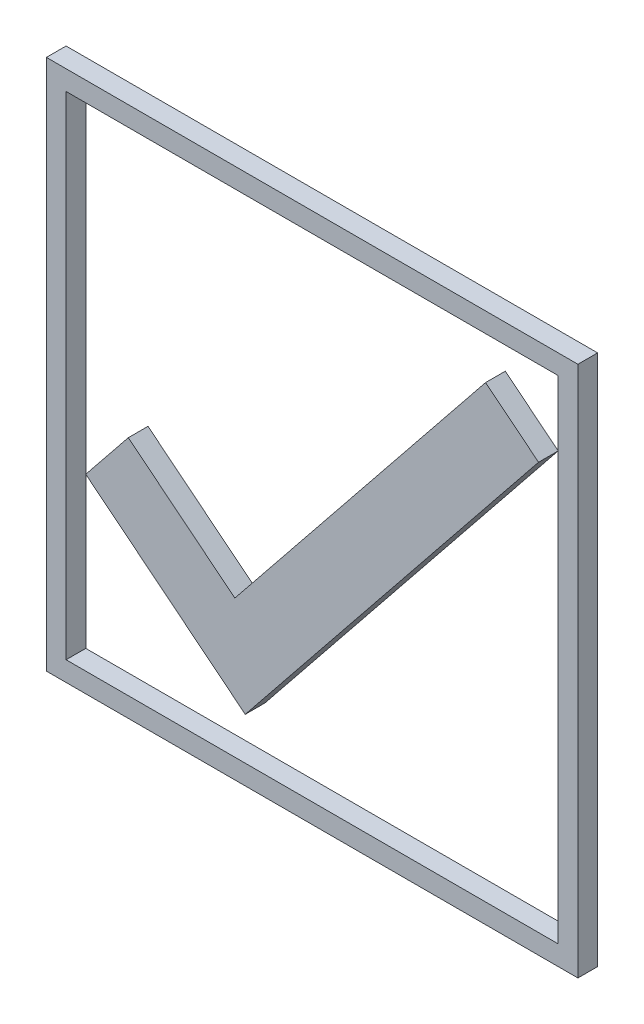
ISO-10303-21;
HEADER;
FILE_DESCRIPTION(('STEP AP214'),'2;1');
FILE_NAME('part.step','',(''),(''),'','','');
FILE_SCHEMA(('AUTOMOTIVE_DESIGN { 1 0 10303 214 1 1 1 1 }'));
ENDSEC;
DATA;
#1=APPLICATION_CONTEXT('core data for automotive mechanical design processes');
#2=APPLICATION_PROTOCOL_DEFINITION('international standard','automotive_design',2000,#1);
#3=PRODUCT_CONTEXT('',#1,'mechanical');
#4=PRODUCT('Part','Part','',(#3));
#5=PRODUCT_RELATED_PRODUCT_CATEGORY('part','',(#4));
#6=PRODUCT_DEFINITION_FORMATION('','',#4);
#7=PRODUCT_DEFINITION_CONTEXT('part definition',#1,'design');
#8=PRODUCT_DEFINITION('design','',#6,#7);
#9=PRODUCT_DEFINITION_SHAPE('','',#8);
#10=(LENGTH_UNIT() NAMED_UNIT(*) SI_UNIT(.MILLI.,.METRE.));
#11=(NAMED_UNIT(*) PLANE_ANGLE_UNIT() SI_UNIT($,.RADIAN.));
#12=(NAMED_UNIT(*) SI_UNIT($,.STERADIAN.) SOLID_ANGLE_UNIT());
#13=UNCERTAINTY_MEASURE_WITH_UNIT(LENGTH_MEASURE(1.E-05),#10,'distance_accuracy_value','');
#14=(GEOMETRIC_REPRESENTATION_CONTEXT(3) GLOBAL_UNCERTAINTY_ASSIGNED_CONTEXT((#13)) GLOBAL_UNIT_ASSIGNED_CONTEXT((#10,
#11,#12)) REPRESENTATION_CONTEXT('',''));
#15=CARTESIAN_POINT('',(0.,0.,0.));
#16=DIRECTION('',(0.,0.,1.));
#17=DIRECTION('',(1.,0.,0.));
#18=AXIS2_PLACEMENT_3D('',#15,#16,#17);
#19=CARTESIAN_POINT('',(0.,-27.,2.));
#20=DIRECTION('',(0.,1.,0.));
#21=DIRECTION('',(0.,0.,1.));
#22=AXIS2_PLACEMENT_3D('',#19,#20,#21);
#23=PLANE('',#22);
#24=DIRECTION('',(1.,0.,0.));
#25=VECTOR('',#24,1.);
#26=CARTESIAN_POINT('',(0.,-27.,0.));
#27=LINE('',#26,#25);
#28=CARTESIAN_POINT('',(-27.,-27.,0.));
#29=VERTEX_POINT('',#28);
#30=CARTESIAN_POINT('',(27.,-27.,0.));
#31=VERTEX_POINT('',#30);
#32=EDGE_CURVE('E186',#29,#31,#27,.T.);
#33=ORIENTED_EDGE('',*,*,#32,.T.);
#34=DIRECTION('',(0.,0.,-1.));
#35=VECTOR('',#34,1.);
#36=CARTESIAN_POINT('',(27.,-27.,2.));
#37=LINE('',#36,#35);
#38=CARTESIAN_POINT('',(27.,-27.,2.));
#39=VERTEX_POINT('',#38);
#40=EDGE_CURVE('E13',#39,#31,#37,.T.);
#41=ORIENTED_EDGE('',*,*,#40,.F.);
#42=DIRECTION('',(1.,0.,0.));
#43=VECTOR('',#42,1.);
#44=CARTESIAN_POINT('',(0.,-27.,2.));
#45=LINE('',#44,#43);
#46=CARTESIAN_POINT('',(-27.,-27.,2.));
#47=VERTEX_POINT('',#46);
#48=EDGE_CURVE('E158',#47,#39,#45,.T.);
#49=ORIENTED_EDGE('',*,*,#48,.F.);
#50=DIRECTION('',(0.,0.,-1.));
#51=VECTOR('',#50,1.);
#52=CARTESIAN_POINT('',(-27.,-27.,2.));
#53=LINE('',#52,#51);
#54=EDGE_CURVE('E98',#47,#29,#53,.T.);
#55=ORIENTED_EDGE('',*,*,#54,.T.);
#56=EDGE_LOOP('',(#33,#41,#49,#55));
#57=FACE_BOUND('',#56,.T.);
#58=ADVANCED_FACE('F79',(#57),#23,.F.);
#59=CARTESIAN_POINT('',(27.,0.,2.));
#60=DIRECTION('',(-1.,0.,0.));
#61=DIRECTION('',(0.,0.,1.));
#62=AXIS2_PLACEMENT_3D('',#59,#60,#61);
#63=PLANE('',#62);
#64=DIRECTION('',(0.,1.,0.));
#65=VECTOR('',#64,1.);
#66=CARTESIAN_POINT('',(27.,0.,0.));
#67=LINE('',#66,#65);
#68=CARTESIAN_POINT('',(27.,27.,0.));
#69=VERTEX_POINT('',#68);
#70=EDGE_CURVE('E164',#31,#69,#67,.T.);
#71=ORIENTED_EDGE('',*,*,#70,.T.);
#72=DIRECTION('',(0.,0.,-1.));
#73=VECTOR('',#72,1.);
#74=CARTESIAN_POINT('',(27.,27.,2.));
#75=LINE('',#74,#73);
#76=CARTESIAN_POINT('',(27.,27.,2.));
#77=VERTEX_POINT('',#76);
#78=EDGE_CURVE('E89',#77,#69,#75,.T.);
#79=ORIENTED_EDGE('',*,*,#78,.F.);
#80=DIRECTION('',(0.,1.,0.));
#81=VECTOR('',#80,1.);
#82=CARTESIAN_POINT('',(27.,0.,2.));
#83=LINE('',#82,#81);
#84=EDGE_CURVE('E152',#39,#77,#83,.T.);
#85=ORIENTED_EDGE('',*,*,#84,.F.);
#86=ORIENTED_EDGE('',*,*,#40,.T.);
#87=EDGE_LOOP('',(#71,#79,#85,#86));
#88=FACE_BOUND('',#87,.T.);
#89=ADVANCED_FACE('F163',(#88),#63,.F.);
#90=CARTESIAN_POINT('',(0.,27.,2.));
#91=DIRECTION('',(0.,1.,0.));
#92=DIRECTION('',(-1.,0.,0.));
#93=AXIS2_PLACEMENT_3D('',#90,#91,#92);
#94=PLANE('',#93);
#95=DIRECTION('',(1.,0.,0.));
#96=VECTOR('',#95,1.);
#97=CARTESIAN_POINT('',(0.,27.,0.));
#98=LINE('',#97,#96);
#99=CARTESIAN_POINT('',(-27.,27.,0.));
#100=VERTEX_POINT('',#99);
#101=EDGE_CURVE('E189',#100,#69,#98,.T.);
#102=ORIENTED_EDGE('',*,*,#101,.F.);
#103=DIRECTION('',(0.,0.,-1.));
#104=VECTOR('',#103,1.);
#105=CARTESIAN_POINT('',(-27.,27.,2.));
#106=LINE('',#105,#104);
#107=CARTESIAN_POINT('',(-27.,27.,2.));
#108=VERTEX_POINT('',#107);
#109=EDGE_CURVE('E124',#108,#100,#106,.T.);
#110=ORIENTED_EDGE('',*,*,#109,.F.);
#111=DIRECTION('',(1.,0.,0.));
#112=VECTOR('',#111,1.);
#113=CARTESIAN_POINT('',(0.,27.,2.));
#114=LINE('',#113,#112);
#115=EDGE_CURVE('E157',#108,#77,#114,.T.);
#116=ORIENTED_EDGE('',*,*,#115,.T.);
#117=ORIENTED_EDGE('',*,*,#78,.T.);
#118=EDGE_LOOP('',(#102,#110,#116,#117));
#119=FACE_BOUND('',#118,.T.);
#120=ADVANCED_FACE('F168',(#119),#94,.T.);
#121=CARTESIAN_POINT('',(25.,0.,2.));
#122=DIRECTION('',(-1.,0.,0.));
#123=DIRECTION('',(0.,0.,1.));
#124=AXIS2_PLACEMENT_3D('',#121,#122,#123);
#125=PLANE('',#124);
#126=DIRECTION('',(0.,1.,0.));
#127=VECTOR('',#126,1.);
#128=CARTESIAN_POINT('',(25.,0.,0.));
#129=LINE('',#128,#127);
#130=CARTESIAN_POINT('',(25.,-25.,0.));
#131=VERTEX_POINT('',#130);
#132=CARTESIAN_POINT('',(25.,25.,0.));
#133=VERTEX_POINT('',#132);
#134=EDGE_CURVE('E175',#131,#133,#129,.T.);
#135=ORIENTED_EDGE('',*,*,#134,.F.);
#136=DIRECTION('',(0.,0.,-1.));
#137=VECTOR('',#136,1.);
#138=CARTESIAN_POINT('',(25.,-25.,2.));
#139=LINE('',#138,#137);
#140=CARTESIAN_POINT('',(25.,-25.,2.));
#141=VERTEX_POINT('',#140);
#142=EDGE_CURVE('E83',#141,#131,#139,.T.);
#143=ORIENTED_EDGE('',*,*,#142,.F.);
#144=DIRECTION('',(0.,1.,0.));
#145=VECTOR('',#144,1.);
#146=CARTESIAN_POINT('',(25.,0.,2.));
#147=LINE('',#146,#145);
#148=CARTESIAN_POINT('',(25.,25.,2.));
#149=VERTEX_POINT('',#148);
#150=EDGE_CURVE('E194',#141,#149,#147,.T.);
#151=ORIENTED_EDGE('',*,*,#150,.T.);
#152=DIRECTION('',(0.,0.,-1.));
#153=VECTOR('',#152,1.);
#154=CARTESIAN_POINT('',(25.,25.,2.));
#155=LINE('',#154,#153);
#156=EDGE_CURVE('E171',#149,#133,#155,.T.);
#157=ORIENTED_EDGE('',*,*,#156,.T.);
#158=EDGE_LOOP('',(#135,#143,#151,#157));
#159=FACE_BOUND('',#158,.T.);
#160=ADVANCED_FACE('F81',(#159),#125,.T.);
#161=CARTESIAN_POINT('',(0.,-25.,2.));
#162=DIRECTION('',(0.,1.,0.));
#163=DIRECTION('',(-1.,0.,0.));
#164=AXIS2_PLACEMENT_3D('',#161,#162,#163);
#165=PLANE('',#164);
#166=DIRECTION('',(1.,0.,0.));
#167=VECTOR('',#166,1.);
#168=CARTESIAN_POINT('',(0.,-25.,0.));
#169=LINE('',#168,#167);
#170=CARTESIAN_POINT('',(-25.,-25.,0.));
#171=VERTEX_POINT('',#170);
#172=EDGE_CURVE('E178',#171,#131,#169,.T.);
#173=ORIENTED_EDGE('',*,*,#172,.F.);
#174=DIRECTION('',(0.,0.,-1.));
#175=VECTOR('',#174,1.);
#176=CARTESIAN_POINT('',(-25.,-25.,2.));
#177=LINE('',#176,#175);
#178=CARTESIAN_POINT('',(-25.,-25.,2.));
#179=VERTEX_POINT('',#178);
#180=EDGE_CURVE('E200',#179,#171,#177,.T.);
#181=ORIENTED_EDGE('',*,*,#180,.F.);
#182=DIRECTION('',(1.,0.,0.));
#183=VECTOR('',#182,1.);
#184=CARTESIAN_POINT('',(0.,-25.,2.));
#185=LINE('',#184,#183);
#186=EDGE_CURVE('E209',#179,#141,#185,.T.);
#187=ORIENTED_EDGE('',*,*,#186,.T.);
#188=ORIENTED_EDGE('',*,*,#142,.T.);
#189=EDGE_LOOP('',(#173,#181,#187,#188));
#190=FACE_BOUND('',#189,.T.);
#191=ADVANCED_FACE('F207',(#190),#165,.T.);
#192=CARTESIAN_POINT('',(-25.,0.,2.));
#193=DIRECTION('',(-1.,0.,0.));
#194=DIRECTION('',(0.,0.,1.));
#195=AXIS2_PLACEMENT_3D('',#192,#193,#194);
#196=PLANE('',#195);
#197=DIRECTION('',(0.,1.,0.));
#198=VECTOR('',#197,1.);
#199=CARTESIAN_POINT('',(-25.,0.,0.));
#200=LINE('',#199,#198);
#201=CARTESIAN_POINT('',(-25.,25.,0.));
#202=VERTEX_POINT('',#201);
#203=EDGE_CURVE('E181',#171,#202,#200,.T.);
#204=ORIENTED_EDGE('',*,*,#203,.T.);
#205=DIRECTION('',(0.,0.,-1.));
#206=VECTOR('',#205,1.);
#207=CARTESIAN_POINT('',(-25.,25.,2.));
#208=LINE('',#207,#206);
#209=CARTESIAN_POINT('',(-25.,25.,2.));
#210=VERTEX_POINT('',#209);
#211=EDGE_CURVE('E198',#210,#202,#208,.T.);
#212=ORIENTED_EDGE('',*,*,#211,.F.);
#213=DIRECTION('',(0.,1.,0.));
#214=VECTOR('',#213,1.);
#215=CARTESIAN_POINT('',(-25.,0.,2.));
#216=LINE('',#215,#214);
#217=EDGE_CURVE('E222',#179,#210,#216,.T.);
#218=ORIENTED_EDGE('',*,*,#217,.F.);
#219=ORIENTED_EDGE('',*,*,#180,.T.);
#220=EDGE_LOOP('',(#204,#212,#218,#219));
#221=FACE_BOUND('',#220,.T.);
#222=ADVANCED_FACE('F216',(#221),#196,.F.);
#223=CARTESIAN_POINT('',(0.,25.,2.));
#224=DIRECTION('',(0.,1.,0.));
#225=DIRECTION('',(-1.,0.,0.));
#226=AXIS2_PLACEMENT_3D('',#223,#224,#225);
#227=PLANE('',#226);
#228=DIRECTION('',(1.,0.,0.));
#229=VECTOR('',#228,1.);
#230=CARTESIAN_POINT('',(0.,25.,0.));
#231=LINE('',#230,#229);
#232=EDGE_CURVE('E183',#202,#133,#231,.T.);
#233=ORIENTED_EDGE('',*,*,#232,.T.);
#234=ORIENTED_EDGE('',*,*,#156,.F.);
#235=DIRECTION('',(1.,0.,0.));
#236=VECTOR('',#235,1.);
#237=CARTESIAN_POINT('',(0.,25.,2.));
#238=LINE('',#237,#236);
#239=EDGE_CURVE('E220',#210,#149,#238,.T.);
#240=ORIENTED_EDGE('',*,*,#239,.F.);
#241=ORIENTED_EDGE('',*,*,#211,.T.);
#242=EDGE_LOOP('',(#233,#234,#240,#241));
#243=FACE_BOUND('',#242,.T.);
#244=ADVANCED_FACE('F219',(#243),#227,.F.);
#245=CARTESIAN_POINT('',(-27.,0.,2.));
#246=DIRECTION('',(-1.,0.,0.));
#247=DIRECTION('',(0.,0.,1.));
#248=AXIS2_PLACEMENT_3D('',#245,#246,#247);
#249=PLANE('',#248);
#250=DIRECTION('',(0.,1.,0.));
#251=VECTOR('',#250,1.);
#252=CARTESIAN_POINT('',(-27.,0.,0.));
#253=LINE('',#252,#251);
#254=EDGE_CURVE('E191',#29,#100,#253,.T.);
#255=ORIENTED_EDGE('',*,*,#254,.F.);
#256=ORIENTED_EDGE('',*,*,#54,.F.);
#257=DIRECTION('',(0.,1.,0.));
#258=VECTOR('',#257,1.);
#259=CARTESIAN_POINT('',(-27.,0.,2.));
#260=LINE('',#259,#258);
#261=EDGE_CURVE('E169',#47,#108,#260,.T.);
#262=ORIENTED_EDGE('',*,*,#261,.T.);
#263=ORIENTED_EDGE('',*,*,#109,.T.);
#264=EDGE_LOOP('',(#255,#256,#262,#263));
#265=FACE_BOUND('',#264,.T.);
#266=ADVANCED_FACE('F228',(#265),#249,.T.);
#267=CARTESIAN_POINT('',(0.,0.,2.));
#268=DIRECTION('',(0.,0.,1.));
#269=DIRECTION('',(1.,0.,0.));
#270=AXIS2_PLACEMENT_3D('',#267,#268,#269);
#271=PLANE('',#270);
#272=ORIENTED_EDGE('',*,*,#150,.F.);
#273=ORIENTED_EDGE('',*,*,#186,.F.);
#274=ORIENTED_EDGE('',*,*,#217,.T.);
#275=ORIENTED_EDGE('',*,*,#239,.T.);
#276=EDGE_LOOP('',(#272,#273,#274,#275));
#277=FACE_BOUND('',#276,.T.);
#278=ORIENTED_EDGE('',*,*,#48,.T.);
#279=ORIENTED_EDGE('',*,*,#84,.T.);
#280=ORIENTED_EDGE('',*,*,#115,.F.);
#281=ORIENTED_EDGE('',*,*,#261,.F.);
#282=EDGE_LOOP('',(#278,#279,#280,#281));
#283=FACE_BOUND('',#282,.T.);
#284=ADVANCED_FACE('F154',(#277,#283),#271,.T.);
#285=CARTESIAN_POINT('',(0.,0.,0.));
#286=DIRECTION('',(0.,0.,1.));
#287=DIRECTION('',(1.,0.,0.));
#288=AXIS2_PLACEMENT_3D('',#285,#286,#287);
#289=PLANE('',#288);
#290=ORIENTED_EDGE('',*,*,#134,.T.);
#291=ORIENTED_EDGE('',*,*,#232,.F.);
#292=ORIENTED_EDGE('',*,*,#203,.F.);
#293=ORIENTED_EDGE('',*,*,#172,.T.);
#294=EDGE_LOOP('',(#290,#291,#292,#293));
#295=FACE_BOUND('',#294,.T.);
#296=ORIENTED_EDGE('',*,*,#32,.F.);
#297=ORIENTED_EDGE('',*,*,#254,.T.);
#298=ORIENTED_EDGE('',*,*,#101,.T.);
#299=ORIENTED_EDGE('',*,*,#70,.F.);
#300=EDGE_LOOP('',(#296,#297,#298,#299));
#301=FACE_BOUND('',#300,.T.);
#302=ADVANCED_FACE('F213',(#295,#301),#289,.F.);
#303=CLOSED_SHELL('',(#58,#89,#120,#160,#191,#222,#244,#266,#284,#302));
#304=MANIFOLD_SOLID_BREP('B2',#303);
#305=CARTESIAN_POINT('',(0.599445364005211,-0.481726650897162,2.));
#306=DIRECTION('',(-0.779490214472782,0.626414404001997,0.));
#307=DIRECTION('',(-0.626414404001997,-0.779490214472782,0.));
#308=AXIS2_PLACEMENT_3D('',#305,#306,#307);
#309=PLANE('',#308);
#310=DIRECTION('',(0.626414404001997,0.779490214472782,0.));
#311=VECTOR('',#310,1.);
#312=CARTESIAN_POINT('',(0.599445364005211,-0.481726650897162,0.));
#313=LINE('',#312,#311);
#314=CARTESIAN_POINT('',(-7.85265973277477,-10.999258132524,0.));
#315=VERTEX_POINT('',#314);
#316=CARTESIAN_POINT('',(17.6215175201378,20.7,0.));
#317=VERTEX_POINT('',#316);
#318=EDGE_CURVE('E389',#315,#317,#313,.T.);
#319=ORIENTED_EDGE('',*,*,#318,.F.);
#320=DIRECTION('',(0.,0.,-1.));
#321=VECTOR('',#320,1.);
#322=CARTESIAN_POINT('',(-7.85265973277477,-10.999258132524,2.));
#323=LINE('',#322,#321);
#324=CARTESIAN_POINT('',(-7.85265973277477,-10.999258132524,2.));
#325=VERTEX_POINT('',#324);
#326=EDGE_CURVE('E77',#325,#315,#323,.T.);
#327=ORIENTED_EDGE('',*,*,#326,.F.);
#328=DIRECTION('',(0.626414404001997,0.779490214472782,0.));
#329=VECTOR('',#328,1.);
#330=CARTESIAN_POINT('',(0.599445364005211,-0.481726650897162,2.));
#331=LINE('',#330,#329);
#332=CARTESIAN_POINT('',(17.6215175201378,20.7,2.));
#333=VERTEX_POINT('',#332);
#334=EDGE_CURVE('E402',#325,#333,#331,.T.);
#335=ORIENTED_EDGE('',*,*,#334,.T.);
#336=DIRECTION('',(0.,0.,-1.));
#337=VECTOR('',#336,1.);
#338=CARTESIAN_POINT('',(17.6215175201378,20.7,2.));
#339=LINE('',#338,#337);
#340=EDGE_CURVE('E354',#333,#317,#339,.T.);
#341=ORIENTED_EDGE('',*,*,#340,.T.);
#342=EDGE_LOOP('',(#319,#327,#335,#341));
#343=FACE_BOUND('',#342,.T.);
#344=ADVANCED_FACE('F309',(#343),#309,.T.);
#345=CARTESIAN_POINT('',(-8.45210509677998,-10.5175314816268,2.));
#346=DIRECTION('',(0.626414404001997,0.779490214472781,0.));
#347=DIRECTION('',(-0.779490214472781,0.626414404001997,0.));
#348=AXIS2_PLACEMENT_3D('',#345,#346,#347);
#349=PLANE('',#348);
#350=DIRECTION('',(0.779490214472781,-0.626414404001997,0.));
#351=VECTOR('',#350,1.);
#352=CARTESIAN_POINT('',(-8.45210509677998,-10.5175314816268,0.));
#353=LINE('',#352,#351);
#354=CARTESIAN_POINT('',(-18.6777406123862,-2.3,0.));
#355=VERTEX_POINT('',#354);
#356=EDGE_CURVE('E392',#355,#315,#353,.T.);
#357=ORIENTED_EDGE('',*,*,#356,.F.);
#358=DIRECTION('',(0.,0.,-1.));
#359=VECTOR('',#358,1.);
#360=CARTESIAN_POINT('',(-18.6777406123862,-2.3,2.));
#361=LINE('',#360,#359);
#362=CARTESIAN_POINT('',(-18.6777406123862,-2.3,2.));
#363=VERTEX_POINT('',#362);
#364=EDGE_CURVE('E317',#363,#355,#361,.T.);
#365=ORIENTED_EDGE('',*,*,#364,.F.);
#366=DIRECTION('',(0.779490214472781,-0.626414404001997,0.));
#367=VECTOR('',#366,1.);
#368=CARTESIAN_POINT('',(-8.45210509677998,-10.5175314816268,2.));
#369=LINE('',#368,#367);
#370=EDGE_CURVE('E417',#363,#325,#369,.T.);
#371=ORIENTED_EDGE('',*,*,#370,.T.);
#372=ORIENTED_EDGE('',*,*,#326,.T.);
#373=EDGE_LOOP('',(#357,#365,#371,#372));
#374=FACE_BOUND('',#373,.T.);
#375=ADVANCED_FACE('F411',(#374),#349,.T.);
#376=CARTESIAN_POINT('',(-10.2256355156062,8.21753148162683,2.));
#377=DIRECTION('',(-0.779490214472782,0.626414404001997,0.));
#378=DIRECTION('',(-0.626414404001997,-0.779490214472782,0.));
#379=AXIS2_PLACEMENT_3D('',#376,#377,#378);
#380=PLANE('',#379);
#381=DIRECTION('',(0.626414404001997,0.779490214472782,0.));
#382=VECTOR('',#381,1.);
#383=CARTESIAN_POINT('',(-10.2256355156062,8.21753148162683,0.));
#384=LINE('',#383,#382);
#385=CARTESIAN_POINT('',(-23.,-7.67848247986219,0.));
#386=VERTEX_POINT('',#385);
#387=EDGE_CURVE('E395',#386,#355,#384,.T.);
#388=ORIENTED_EDGE('',*,*,#387,.F.);
#389=DIRECTION('',(0.,0.,-1.));
#390=VECTOR('',#389,1.);
#391=CARTESIAN_POINT('',(-23.,-7.67848247986219,2.));
#392=LINE('',#391,#390);
#393=CARTESIAN_POINT('',(-23.,-7.67848247986219,2.));
#394=VERTEX_POINT('',#393);
#395=EDGE_CURVE('E381',#394,#386,#392,.T.);
#396=ORIENTED_EDGE('',*,*,#395,.F.);
#397=DIRECTION('',(0.626414404001997,0.779490214472782,0.));
#398=VECTOR('',#397,1.);
#399=CARTESIAN_POINT('',(-10.2256355156062,8.21753148162683,2.));
#400=LINE('',#399,#398);
#401=EDGE_CURVE('E374',#394,#363,#400,.T.);
#402=ORIENTED_EDGE('',*,*,#401,.T.);
#403=ORIENTED_EDGE('',*,*,#364,.T.);
#404=EDGE_LOOP('',(#388,#396,#402,#403));
#405=FACE_BOUND('',#404,.T.);
#406=ADVANCED_FACE('F408',(#405),#380,.T.);
#407=CARTESIAN_POINT('',(-12.7743644843938,-15.896013961489,2.));
#408=DIRECTION('',(0.626414404001997,0.779490214472781,0.));
#409=DIRECTION('',(-0.779490214472781,0.626414404001997,0.));
#410=AXIS2_PLACEMENT_3D('',#407,#408,#409);
#411=PLANE('',#410);
#412=DIRECTION('',(0.779490214472781,-0.626414404001997,0.));
#413=VECTOR('',#412,1.);
#414=CARTESIAN_POINT('',(-12.7743644843938,-15.896013961489,0.));
#415=LINE('',#414,#413);
#416=CARTESIAN_POINT('',(-6.79643664052633,-20.7,0.));
#417=VERTEX_POINT('',#416);
#418=EDGE_CURVE('E380',#386,#417,#415,.T.);
#419=ORIENTED_EDGE('',*,*,#418,.T.);
#420=DIRECTION('',(0.,0.,-1.));
#421=VECTOR('',#420,1.);
#422=CARTESIAN_POINT('',(-6.79643664052633,-20.7,2.));
#423=LINE('',#422,#421);
#424=CARTESIAN_POINT('',(-6.79643664052633,-20.7,2.));
#425=VERTEX_POINT('',#424);
#426=EDGE_CURVE('E377',#425,#417,#423,.T.);
#427=ORIENTED_EDGE('',*,*,#426,.F.);
#428=DIRECTION('',(0.779490214472781,-0.626414404001997,0.));
#429=VECTOR('',#428,1.);
#430=CARTESIAN_POINT('',(-12.7743644843938,-15.896013961489,2.));
#431=LINE('',#430,#429);
#432=EDGE_CURVE('E367',#394,#425,#431,.T.);
#433=ORIENTED_EDGE('',*,*,#432,.F.);
#434=ORIENTED_EDGE('',*,*,#395,.T.);
#435=EDGE_LOOP('',(#419,#427,#433,#434));
#436=FACE_BOUND('',#435,.T.);
#437=ADVANCED_FACE('F378',(#436),#411,.F.);
#438=CARTESIAN_POINT('',(5.97792784386742,-4.80398603851095,2.));
#439=DIRECTION('',(-0.779490214472782,0.626414404001996,0.));
#440=DIRECTION('',(-0.626414404001996,-0.779490214472782,0.));
#441=AXIS2_PLACEMENT_3D('',#438,#439,#440);
#442=PLANE('',#441);
#443=DIRECTION('',(0.626414404001996,0.779490214472782,0.));
#444=VECTOR('',#443,1.);
#445=CARTESIAN_POINT('',(5.97792784386742,-4.80398603851095,0.));
#446=LINE('',#445,#444);
#447=CARTESIAN_POINT('',(23.,16.3777406123862,0.));
#448=VERTEX_POINT('',#447);
#449=EDGE_CURVE('E347',#417,#448,#446,.T.);
#450=ORIENTED_EDGE('',*,*,#449,.T.);
#451=DIRECTION('',(0.,0.,-1.));
#452=VECTOR('',#451,1.);
#453=CARTESIAN_POINT('',(23.,16.3777406123862,2.));
#454=LINE('',#453,#452);
#455=CARTESIAN_POINT('',(23.,16.3777406123862,2.));
#456=VERTEX_POINT('',#455);
#457=EDGE_CURVE('E382',#456,#448,#454,.T.);
#458=ORIENTED_EDGE('',*,*,#457,.F.);
#459=DIRECTION('',(0.626414404001996,0.779490214472782,0.));
#460=VECTOR('',#459,1.);
#461=CARTESIAN_POINT('',(5.97792784386742,-4.80398603851095,2.));
#462=LINE('',#461,#460);
#463=EDGE_CURVE('E371',#425,#456,#462,.T.);
#464=ORIENTED_EDGE('',*,*,#463,.F.);
#465=ORIENTED_EDGE('',*,*,#426,.T.);
#466=EDGE_LOOP('',(#450,#458,#464,#465));
#467=FACE_BOUND('',#466,.T.);
#468=ADVANCED_FACE('F384',(#467),#442,.F.);
#469=CARTESIAN_POINT('',(17.0220721561326,21.1817266508972,2.));
#470=DIRECTION('',(-0.626414404001997,-0.779490214472782,0.));
#471=DIRECTION('',(0.779490214472782,-0.626414404001997,0.));
#472=AXIS2_PLACEMENT_3D('',#469,#470,#471);
#473=PLANE('',#472);
#474=DIRECTION('',(-0.779490214472782,0.626414404001997,0.));
#475=VECTOR('',#474,1.);
#476=CARTESIAN_POINT('',(17.0220721561326,21.1817266508972,0.));
#477=LINE('',#476,#475);
#478=EDGE_CURVE('E400',#448,#317,#477,.T.);
#479=ORIENTED_EDGE('',*,*,#478,.T.);
#480=ORIENTED_EDGE('',*,*,#340,.F.);
#481=DIRECTION('',(-0.779490214472782,0.626414404001997,0.));
#482=VECTOR('',#481,1.);
#483=CARTESIAN_POINT('',(17.0220721561326,21.1817266508972,2.));
#484=LINE('',#483,#482);
#485=EDGE_CURVE('E325',#456,#333,#484,.T.);
#486=ORIENTED_EDGE('',*,*,#485,.F.);
#487=ORIENTED_EDGE('',*,*,#457,.T.);
#488=EDGE_LOOP('',(#479,#480,#486,#487));
#489=FACE_BOUND('',#488,.T.);
#490=ADVANCED_FACE('F416',(#489),#473,.F.);
#491=CARTESIAN_POINT('',(0.,0.,2.));
#492=DIRECTION('',(0.,0.,1.));
#493=DIRECTION('',(1.,0.,0.));
#494=AXIS2_PLACEMENT_3D('',#491,#492,#493);
#495=PLANE('',#494);
#496=ORIENTED_EDGE('',*,*,#334,.F.);
#497=ORIENTED_EDGE('',*,*,#370,.F.);
#498=ORIENTED_EDGE('',*,*,#401,.F.);
#499=ORIENTED_EDGE('',*,*,#432,.T.);
#500=ORIENTED_EDGE('',*,*,#463,.T.);
#501=ORIENTED_EDGE('',*,*,#485,.T.);
#502=EDGE_LOOP('',(#496,#497,#498,#499,#500,#501));
#503=FACE_BOUND('',#502,.T.);
#504=ADVANCED_FACE('F369',(#503),#495,.T.);
#505=CARTESIAN_POINT('',(0.,0.,0.));
#506=DIRECTION('',(0.,0.,1.));
#507=DIRECTION('',(1.,0.,0.));
#508=AXIS2_PLACEMENT_3D('',#505,#506,#507);
#509=PLANE('',#508);
#510=ORIENTED_EDGE('',*,*,#318,.T.);
#511=ORIENTED_EDGE('',*,*,#478,.F.);
#512=ORIENTED_EDGE('',*,*,#449,.F.);
#513=ORIENTED_EDGE('',*,*,#418,.F.);
#514=ORIENTED_EDGE('',*,*,#387,.T.);
#515=ORIENTED_EDGE('',*,*,#356,.T.);
#516=EDGE_LOOP('',(#510,#511,#512,#513,#514,#515));
#517=FACE_BOUND('',#516,.T.);
#518=ADVANCED_FACE('F413',(#517),#509,.F.);
#519=CLOSED_SHELL('',(#344,#375,#406,#437,#468,#490,#504,#518));
#520=MANIFOLD_SOLID_BREP('B7',#519);
#521=ADVANCED_BREP_SHAPE_REPRESENTATION('',(#18,#304,#520),#14);
#522=SHAPE_DEFINITION_REPRESENTATION(#9,#521);
ENDSEC;
END-ISO-10303-21;
